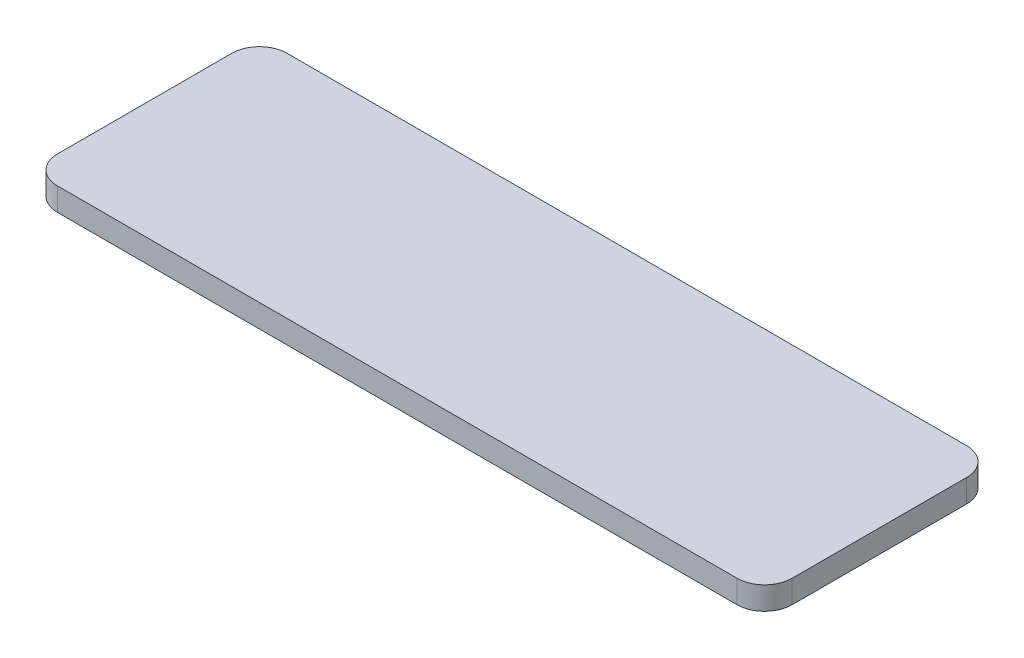
ISO-10303-21;
HEADER;
FILE_DESCRIPTION(('STEP AP214'),'2;1');
FILE_NAME('part.step','',(''),(''),'','','');
FILE_SCHEMA(('AUTOMOTIVE_DESIGN { 1 0 10303 214 1 1 1 1 }'));
ENDSEC;
DATA;
#1=APPLICATION_CONTEXT('core data for automotive mechanical design processes');
#2=APPLICATION_PROTOCOL_DEFINITION('international standard','automotive_design',2000,#1);
#3=PRODUCT_CONTEXT('',#1,'mechanical');
#4=PRODUCT('Part','Part','',(#3));
#5=PRODUCT_RELATED_PRODUCT_CATEGORY('part','',(#4));
#6=PRODUCT_DEFINITION_FORMATION('','',#4);
#7=PRODUCT_DEFINITION_CONTEXT('part definition',#1,'design');
#8=PRODUCT_DEFINITION('design','',#6,#7);
#9=PRODUCT_DEFINITION_SHAPE('','',#8);
#10=(LENGTH_UNIT() NAMED_UNIT(*) SI_UNIT(.MILLI.,.METRE.));
#11=(NAMED_UNIT(*) PLANE_ANGLE_UNIT() SI_UNIT($,.RADIAN.));
#12=(NAMED_UNIT(*) SI_UNIT($,.STERADIAN.) SOLID_ANGLE_UNIT());
#13=UNCERTAINTY_MEASURE_WITH_UNIT(LENGTH_MEASURE(1.E-05),#10,'distance_accuracy_value','');
#14=(GEOMETRIC_REPRESENTATION_CONTEXT(3) GLOBAL_UNCERTAINTY_ASSIGNED_CONTEXT((#13)) GLOBAL_UNIT_ASSIGNED_CONTEXT((#10,
#11,#12)) REPRESENTATION_CONTEXT('',''));
#15=CARTESIAN_POINT('',(0.,0.,0.));
#16=DIRECTION('',(0.,0.,1.));
#17=DIRECTION('',(1.,0.,0.));
#18=AXIS2_PLACEMENT_3D('',#15,#16,#17);
#19=CARTESIAN_POINT('',(148.,5.,44.));
#20=DIRECTION('',(0.,-1.,0.));
#21=DIRECTION('',(0.,0.,-1.));
#22=AXIS2_PLACEMENT_3D('',#19,#20,#21);
#23=CYLINDRICAL_SURFACE('',#22,6.);
#24=CARTESIAN_POINT('',(148.,0.,44.));
#25=DIRECTION('',(0.,1.,0.));
#26=DIRECTION('',(0.,0.,-1.));
#27=AXIS2_PLACEMENT_3D('',#24,#25,#26);
#28=CIRCLE('',#27,6.);
#29=CARTESIAN_POINT('',(148.,0.,50.));
#30=VERTEX_POINT('',#29);
#31=CARTESIAN_POINT('',(154.,0.,44.));
#32=VERTEX_POINT('',#31);
#33=EDGE_CURVE('E129',#30,#32,#28,.T.);
#34=ORIENTED_EDGE('',*,*,#33,.T.);
#35=DIRECTION('',(0.,-1.,0.));
#36=VECTOR('',#35,1.);
#37=CARTESIAN_POINT('',(154.,5.,44.));
#38=LINE('',#37,#36);
#39=CARTESIAN_POINT('',(154.,5.,44.));
#40=VERTEX_POINT('',#39);
#41=EDGE_CURVE('E11',#40,#32,#38,.T.);
#42=ORIENTED_EDGE('',*,*,#41,.F.);
#43=CARTESIAN_POINT('',(148.,5.,44.));
#44=DIRECTION('',(0.,1.,0.));
#45=DIRECTION('',(0.,0.,-1.));
#46=AXIS2_PLACEMENT_3D('',#43,#44,#45);
#47=CIRCLE('',#46,6.);
#48=CARTESIAN_POINT('',(148.,5.,50.));
#49=VERTEX_POINT('',#48);
#50=EDGE_CURVE('E143',#49,#40,#47,.T.);
#51=ORIENTED_EDGE('',*,*,#50,.F.);
#52=DIRECTION('',(0.,-1.,0.));
#53=VECTOR('',#52,1.);
#54=CARTESIAN_POINT('',(148.,5.,50.));
#55=LINE('',#54,#53);
#56=EDGE_CURVE('E125',#49,#30,#55,.T.);
#57=ORIENTED_EDGE('',*,*,#56,.T.);
#58=EDGE_LOOP('',(#34,#42,#51,#57));
#59=FACE_BOUND('',#58,.T.);
#60=ADVANCED_FACE('F33',(#59),#23,.T.);
#61=CARTESIAN_POINT('',(154.,5.,5.99999999999998));
#62=DIRECTION('',(-1.,0.,0.));
#63=DIRECTION('',(0.,0.,1.));
#64=AXIS2_PLACEMENT_3D('',#61,#62,#63);
#65=PLANE('',#64);
#66=DIRECTION('',(0.,0.,-1.));
#67=VECTOR('',#66,1.);
#68=CARTESIAN_POINT('',(154.,0.,5.99999999999998));
#69=LINE('',#68,#67);
#70=CARTESIAN_POINT('',(154.,0.,5.99999999999998));
#71=VERTEX_POINT('',#70);
#72=EDGE_CURVE('E132',#32,#71,#69,.T.);
#73=ORIENTED_EDGE('',*,*,#72,.T.);
#74=DIRECTION('',(0.,-1.,0.));
#75=VECTOR('',#74,1.);
#76=CARTESIAN_POINT('',(154.,5.,5.99999999999998));
#77=LINE('',#76,#75);
#78=CARTESIAN_POINT('',(154.,5.,5.99999999999998));
#79=VERTEX_POINT('',#78);
#80=EDGE_CURVE('E41',#79,#71,#77,.T.);
#81=ORIENTED_EDGE('',*,*,#80,.F.);
#82=DIRECTION('',(0.,0.,-1.));
#83=VECTOR('',#82,1.);
#84=CARTESIAN_POINT('',(154.,5.,5.99999999999998));
#85=LINE('',#84,#83);
#86=EDGE_CURVE('E92',#40,#79,#85,.T.);
#87=ORIENTED_EDGE('',*,*,#86,.F.);
#88=ORIENTED_EDGE('',*,*,#41,.T.);
#89=EDGE_LOOP('',(#73,#81,#87,#88));
#90=FACE_BOUND('',#89,.T.);
#91=ADVANCED_FACE('F178',(#90),#65,.F.);
#92=CARTESIAN_POINT('',(148.,5.,6.00000000000001));
#93=DIRECTION('',(0.,-1.,0.));
#94=DIRECTION('',(0.,0.,-1.));
#95=AXIS2_PLACEMENT_3D('',#92,#93,#94);
#96=CYLINDRICAL_SURFACE('',#95,6.00000000000001);
#97=CARTESIAN_POINT('',(148.,0.,6.00000000000001));
#98=DIRECTION('',(0.,1.,0.));
#99=DIRECTION('',(0.,0.,1.));
#100=AXIS2_PLACEMENT_3D('',#97,#98,#99);
#101=CIRCLE('',#100,6.00000000000001);
#102=CARTESIAN_POINT('',(148.,0.,0.));
#103=VERTEX_POINT('',#102);
#104=EDGE_CURVE('E134',#71,#103,#101,.T.);
#105=ORIENTED_EDGE('',*,*,#104,.T.);
#106=DIRECTION('',(0.,-1.,0.));
#107=VECTOR('',#106,1.);
#108=CARTESIAN_POINT('',(148.,5.,0.));
#109=LINE('',#108,#107);
#110=CARTESIAN_POINT('',(148.,5.,0.));
#111=VERTEX_POINT('',#110);
#112=EDGE_CURVE('E150',#111,#103,#109,.T.);
#113=ORIENTED_EDGE('',*,*,#112,.F.);
#114=CARTESIAN_POINT('',(148.,5.,6.00000000000001));
#115=DIRECTION('',(0.,1.,0.));
#116=DIRECTION('',(0.,0.,1.));
#117=AXIS2_PLACEMENT_3D('',#114,#115,#116);
#118=CIRCLE('',#117,6.00000000000001);
#119=EDGE_CURVE('E158',#79,#111,#118,.T.);
#120=ORIENTED_EDGE('',*,*,#119,.F.);
#121=ORIENTED_EDGE('',*,*,#80,.T.);
#122=EDGE_LOOP('',(#105,#113,#120,#121));
#123=FACE_BOUND('',#122,.T.);
#124=ADVANCED_FACE('F156',(#123),#96,.T.);
#125=CARTESIAN_POINT('',(0.,5.,0.));
#126=DIRECTION('',(0.,0.,1.));
#127=DIRECTION('',(1.,0.,0.));
#128=AXIS2_PLACEMENT_3D('',#125,#126,#127);
#129=PLANE('',#128);
#130=DIRECTION('',(-1.,0.,0.));
#131=VECTOR('',#130,1.);
#132=CARTESIAN_POINT('',(0.,0.,0.));
#133=LINE('',#132,#131);
#134=CARTESIAN_POINT('',(0.,0.,0.));
#135=VERTEX_POINT('',#134);
#136=EDGE_CURVE('E136',#103,#135,#133,.T.);
#137=ORIENTED_EDGE('',*,*,#136,.T.);
#138=DIRECTION('',(0.,-1.,0.));
#139=VECTOR('',#138,1.);
#140=CARTESIAN_POINT('',(0.,5.,0.));
#141=LINE('',#140,#139);
#142=CARTESIAN_POINT('',(0.,5.,0.));
#143=VERTEX_POINT('',#142);
#144=EDGE_CURVE('E147',#143,#135,#141,.T.);
#145=ORIENTED_EDGE('',*,*,#144,.F.);
#146=DIRECTION('',(-1.,0.,0.));
#147=VECTOR('',#146,1.);
#148=CARTESIAN_POINT('',(0.,5.,0.));
#149=LINE('',#148,#147);
#150=EDGE_CURVE('E170',#111,#143,#149,.T.);
#151=ORIENTED_EDGE('',*,*,#150,.F.);
#152=ORIENTED_EDGE('',*,*,#112,.T.);
#153=EDGE_LOOP('',(#137,#145,#151,#152));
#154=FACE_BOUND('',#153,.T.);
#155=ADVANCED_FACE('F166',(#154),#129,.F.);
#156=CARTESIAN_POINT('',(0.,5.,5.99999999999999));
#157=DIRECTION('',(0.,-1.,0.));
#158=DIRECTION('',(0.,0.,-1.));
#159=AXIS2_PLACEMENT_3D('',#156,#157,#158);
#160=CYLINDRICAL_SURFACE('',#159,6.);
#161=CARTESIAN_POINT('',(0.,0.,5.99999999999999));
#162=DIRECTION('',(0.,1.,0.));
#163=DIRECTION('',(0.,0.,1.));
#164=AXIS2_PLACEMENT_3D('',#161,#162,#163);
#165=CIRCLE('',#164,6.);
#166=CARTESIAN_POINT('',(-6.00000000000001,0.,5.99999999999999));
#167=VERTEX_POINT('',#166);
#168=EDGE_CURVE('E138',#135,#167,#165,.T.);
#169=ORIENTED_EDGE('',*,*,#168,.T.);
#170=DIRECTION('',(0.,-1.,0.));
#171=VECTOR('',#170,1.);
#172=CARTESIAN_POINT('',(-6.00000000000001,5.,5.99999999999999));
#173=LINE('',#172,#171);
#174=CARTESIAN_POINT('',(-6.00000000000001,5.,5.99999999999999));
#175=VERTEX_POINT('',#174);
#176=EDGE_CURVE('E120',#175,#167,#173,.T.);
#177=ORIENTED_EDGE('',*,*,#176,.F.);
#178=CARTESIAN_POINT('',(0.,5.,5.99999999999999));
#179=DIRECTION('',(0.,1.,0.));
#180=DIRECTION('',(0.,0.,1.));
#181=AXIS2_PLACEMENT_3D('',#178,#179,#180);
#182=CIRCLE('',#181,6.);
#183=EDGE_CURVE('E111',#143,#175,#182,.T.);
#184=ORIENTED_EDGE('',*,*,#183,.F.);
#185=ORIENTED_EDGE('',*,*,#144,.T.);
#186=EDGE_LOOP('',(#169,#177,#184,#185));
#187=FACE_BOUND('',#186,.T.);
#188=ADVANCED_FACE('F169',(#187),#160,.T.);
#189=CARTESIAN_POINT('',(-6.00000000000002,5.,5.99999999999999));
#190=DIRECTION('',(1.,0.,0.));
#191=DIRECTION('',(0.,0.,-1.));
#192=AXIS2_PLACEMENT_3D('',#189,#190,#191);
#193=PLANE('',#192);
#194=DIRECTION('',(0.,0.,1.));
#195=VECTOR('',#194,1.);
#196=CARTESIAN_POINT('',(-6.00000000000002,0.,5.99999999999999));
#197=LINE('',#196,#195);
#198=CARTESIAN_POINT('',(-6.00000000000001,0.,44.));
#199=VERTEX_POINT('',#198);
#200=EDGE_CURVE('E119',#167,#199,#197,.T.);
#201=ORIENTED_EDGE('',*,*,#200,.T.);
#202=DIRECTION('',(0.,-1.,0.));
#203=VECTOR('',#202,1.);
#204=CARTESIAN_POINT('',(-6.00000000000001,5.,44.));
#205=LINE('',#204,#203);
#206=CARTESIAN_POINT('',(-6.00000000000001,5.,44.));
#207=VERTEX_POINT('',#206);
#208=EDGE_CURVE('E116',#207,#199,#205,.T.);
#209=ORIENTED_EDGE('',*,*,#208,.F.);
#210=DIRECTION('',(0.,0.,1.));
#211=VECTOR('',#210,1.);
#212=CARTESIAN_POINT('',(-6.00000000000002,5.,5.99999999999999));
#213=LINE('',#212,#211);
#214=EDGE_CURVE('E105',#175,#207,#213,.T.);
#215=ORIENTED_EDGE('',*,*,#214,.F.);
#216=ORIENTED_EDGE('',*,*,#176,.T.);
#217=EDGE_LOOP('',(#201,#209,#215,#216));
#218=FACE_BOUND('',#217,.T.);
#219=ADVANCED_FACE('F117',(#218),#193,.F.);
#220=CARTESIAN_POINT('',(0.,5.,44.));
#221=DIRECTION('',(0.,-1.,0.));
#222=DIRECTION('',(0.,0.,-1.));
#223=AXIS2_PLACEMENT_3D('',#220,#221,#222);
#224=CYLINDRICAL_SURFACE('',#223,6.);
#225=CARTESIAN_POINT('',(0.,0.,44.));
#226=DIRECTION('',(0.,1.,0.));
#227=DIRECTION('',(0.,0.,-1.));
#228=AXIS2_PLACEMENT_3D('',#225,#226,#227);
#229=CIRCLE('',#228,6.);
#230=CARTESIAN_POINT('',(0.,0.,50.));
#231=VERTEX_POINT('',#230);
#232=EDGE_CURVE('E78',#199,#231,#229,.T.);
#233=ORIENTED_EDGE('',*,*,#232,.T.);
#234=DIRECTION('',(0.,-1.,0.));
#235=VECTOR('',#234,1.);
#236=CARTESIAN_POINT('',(0.,5.,50.));
#237=LINE('',#236,#235);
#238=CARTESIAN_POINT('',(0.,5.,50.));
#239=VERTEX_POINT('',#238);
#240=EDGE_CURVE('E121',#239,#231,#237,.T.);
#241=ORIENTED_EDGE('',*,*,#240,.F.);
#242=CARTESIAN_POINT('',(0.,5.,44.));
#243=DIRECTION('',(0.,1.,0.));
#244=DIRECTION('',(0.,0.,-1.));
#245=AXIS2_PLACEMENT_3D('',#242,#243,#244);
#246=CIRCLE('',#245,6.);
#247=EDGE_CURVE('E109',#207,#239,#246,.T.);
#248=ORIENTED_EDGE('',*,*,#247,.F.);
#249=ORIENTED_EDGE('',*,*,#208,.T.);
#250=EDGE_LOOP('',(#233,#241,#248,#249));
#251=FACE_BOUND('',#250,.T.);
#252=ADVANCED_FACE('F123',(#251),#224,.T.);
#253=CARTESIAN_POINT('',(0.,5.,50.));
#254=DIRECTION('',(0.,0.,-1.));
#255=DIRECTION('',(-1.,0.,0.));
#256=AXIS2_PLACEMENT_3D('',#253,#254,#255);
#257=PLANE('',#256);
#258=DIRECTION('',(1.,0.,0.));
#259=VECTOR('',#258,1.);
#260=CARTESIAN_POINT('',(0.,0.,50.));
#261=LINE('',#260,#259);
#262=EDGE_CURVE('E84',#231,#30,#261,.T.);
#263=ORIENTED_EDGE('',*,*,#262,.T.);
#264=ORIENTED_EDGE('',*,*,#56,.F.);
#265=DIRECTION('',(1.,0.,0.));
#266=VECTOR('',#265,1.);
#267=CARTESIAN_POINT('',(0.,5.,50.));
#268=LINE('',#267,#266);
#269=EDGE_CURVE('E49',#239,#49,#268,.T.);
#270=ORIENTED_EDGE('',*,*,#269,.F.);
#271=ORIENTED_EDGE('',*,*,#240,.T.);
#272=EDGE_LOOP('',(#263,#264,#270,#271));
#273=FACE_BOUND('',#272,.T.);
#274=ADVANCED_FACE('F194',(#273),#257,.F.);
#275=CARTESIAN_POINT('',(148.,5.,44.));
#276=DIRECTION('',(0.,-1.,0.));
#277=DIRECTION('',(0.,0.,-1.));
#278=AXIS2_PLACEMENT_3D('',#275,#276,#277);
#279=PLANE('',#278);
#280=ORIENTED_EDGE('',*,*,#50,.T.);
#281=ORIENTED_EDGE('',*,*,#86,.T.);
#282=ORIENTED_EDGE('',*,*,#119,.T.);
#283=ORIENTED_EDGE('',*,*,#150,.T.);
#284=ORIENTED_EDGE('',*,*,#183,.T.);
#285=ORIENTED_EDGE('',*,*,#214,.T.);
#286=ORIENTED_EDGE('',*,*,#247,.T.);
#287=ORIENTED_EDGE('',*,*,#269,.T.);
#288=EDGE_LOOP('',(#280,#281,#282,#283,#284,#285,#286,#287));
#289=FACE_BOUND('',#288,.T.);
#290=ADVANCED_FACE('F107',(#289),#279,.F.);
#291=CARTESIAN_POINT('',(148.,0.,44.));
#292=DIRECTION('',(0.,-1.,0.));
#293=DIRECTION('',(0.,0.,-1.));
#294=AXIS2_PLACEMENT_3D('',#291,#292,#293);
#295=PLANE('',#294);
#296=ORIENTED_EDGE('',*,*,#33,.F.);
#297=ORIENTED_EDGE('',*,*,#262,.F.);
#298=ORIENTED_EDGE('',*,*,#232,.F.);
#299=ORIENTED_EDGE('',*,*,#200,.F.);
#300=ORIENTED_EDGE('',*,*,#168,.F.);
#301=ORIENTED_EDGE('',*,*,#136,.F.);
#302=ORIENTED_EDGE('',*,*,#104,.F.);
#303=ORIENTED_EDGE('',*,*,#72,.F.);
#304=EDGE_LOOP('',(#296,#297,#298,#299,#300,#301,#302,#303));
#305=FACE_BOUND('',#304,.T.);
#306=ADVANCED_FACE('F162',(#305),#295,.T.);
#307=CLOSED_SHELL('',(#60,#91,#124,#155,#188,#219,#252,#274,#290,#306));
#308=MANIFOLD_SOLID_BREP('B2',#307);
#309=ADVANCED_BREP_SHAPE_REPRESENTATION('',(#18,#308),#14);
#310=SHAPE_DEFINITION_REPRESENTATION(#9,#309);
ENDSEC;
END-ISO-10303-21;
